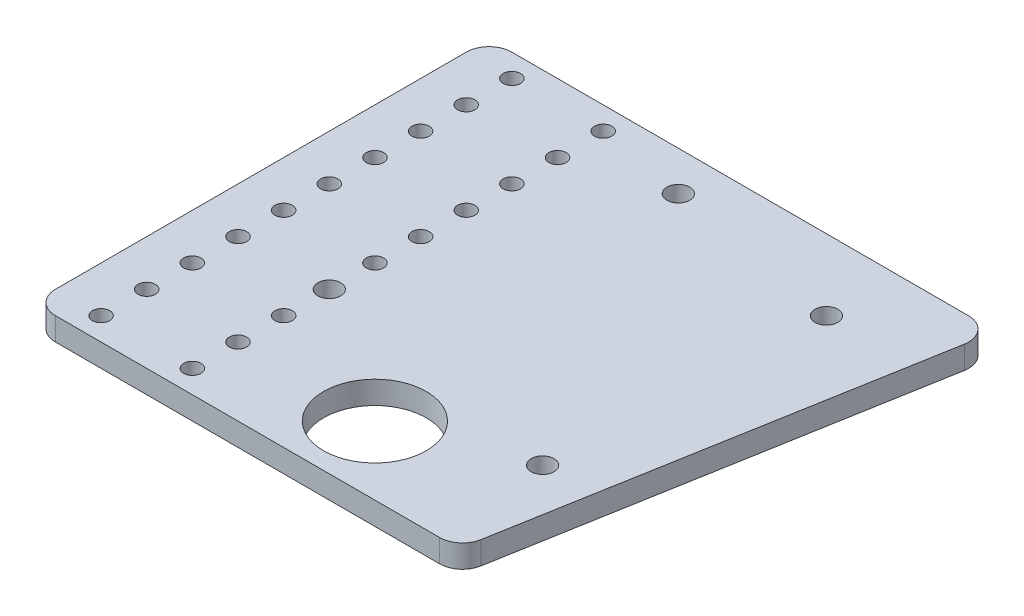
ISO-10303-21;
HEADER;
FILE_DESCRIPTION(('STEP AP214'),'2;1');
FILE_NAME('part.step','',(''),(''),'','','');
FILE_SCHEMA(('AUTOMOTIVE_DESIGN { 1 0 10303 214 1 1 1 1 }'));
ENDSEC;
DATA;
#1=APPLICATION_CONTEXT('core data for automotive mechanical design processes');
#2=APPLICATION_PROTOCOL_DEFINITION('international standard','automotive_design',2000,#1);
#3=PRODUCT_CONTEXT('',#1,'mechanical');
#4=PRODUCT('Part','Part','',(#3));
#5=PRODUCT_RELATED_PRODUCT_CATEGORY('part','',(#4));
#6=PRODUCT_DEFINITION_FORMATION('','',#4);
#7=PRODUCT_DEFINITION_CONTEXT('part definition',#1,'design');
#8=PRODUCT_DEFINITION('design','',#6,#7);
#9=PRODUCT_DEFINITION_SHAPE('','',#8);
#10=(LENGTH_UNIT() NAMED_UNIT(*) SI_UNIT(.MILLI.,.METRE.));
#11=(NAMED_UNIT(*) PLANE_ANGLE_UNIT() SI_UNIT($,.RADIAN.));
#12=(NAMED_UNIT(*) SI_UNIT($,.STERADIAN.) SOLID_ANGLE_UNIT());
#13=UNCERTAINTY_MEASURE_WITH_UNIT(LENGTH_MEASURE(1.E-05),#10,'distance_accuracy_value','');
#14=(GEOMETRIC_REPRESENTATION_CONTEXT(3) GLOBAL_UNCERTAINTY_ASSIGNED_CONTEXT((#13)) GLOBAL_UNIT_ASSIGNED_CONTEXT((#10,
#11,#12)) REPRESENTATION_CONTEXT('',''));
#15=CARTESIAN_POINT('',(0.,0.,0.));
#16=DIRECTION('',(0.,0.,1.));
#17=DIRECTION('',(1.,0.,0.));
#18=AXIS2_PLACEMENT_3D('',#15,#16,#17);
#19=CARTESIAN_POINT('',(-26.303593083181,0.,-62.6287449701072));
#20=DIRECTION('',(0.,1.,0.));
#21=DIRECTION('',(0.,0.,1.));
#22=AXIS2_PLACEMENT_3D('',#19,#20,#21);
#23=CYLINDRICAL_SURFACE('',#22,2.413);
#24=CARTESIAN_POINT('',(-26.303593083181,0.,-62.6287449701072));
#25=DIRECTION('',(0.,1.,0.));
#26=DIRECTION('',(0.,0.,1.));
#27=AXIS2_PLACEMENT_3D('',#24,#25,#26);
#28=CIRCLE('',#27,2.413);
#29=CARTESIAN_POINT('',(-26.303593083181,0.,-60.2157449701072));
#30=VERTEX_POINT('',#29);
#31=EDGE_CURVE('E233',#30,#30,#28,.T.);
#32=ORIENTED_EDGE('',*,*,#31,.F.);
#33=EDGE_LOOP('',(#32));
#34=FACE_BOUND('',#33,.T.);
#35=CARTESIAN_POINT('',(-26.303593083181,6.35,-62.6287449701072));
#36=DIRECTION('',(0.,1.,0.));
#37=DIRECTION('',(0.,0.,1.));
#38=AXIS2_PLACEMENT_3D('',#35,#36,#37);
#39=CIRCLE('',#38,2.413);
#40=CARTESIAN_POINT('',(-26.303593083181,6.35,-60.2157449701072));
#41=VERTEX_POINT('',#40);
#42=EDGE_CURVE('E234',#41,#41,#39,.T.);
#43=ORIENTED_EDGE('',*,*,#42,.T.);
#44=EDGE_LOOP('',(#43));
#45=FACE_BOUND('',#44,.T.);
#46=ADVANCED_FACE('F41',(#34,#45),#23,.F.);
#47=CARTESIAN_POINT('',(-26.303593083181,0.,-49.9287449701072));
#48=DIRECTION('',(0.,1.,0.));
#49=DIRECTION('',(0.,0.,1.));
#50=AXIS2_PLACEMENT_3D('',#47,#48,#49);
#51=CYLINDRICAL_SURFACE('',#50,2.413);
#52=CARTESIAN_POINT('',(-26.303593083181,0.,-49.9287449701072));
#53=DIRECTION('',(0.,1.,0.));
#54=DIRECTION('',(0.,0.,1.));
#55=AXIS2_PLACEMENT_3D('',#52,#53,#54);
#56=CIRCLE('',#55,2.413);
#57=CARTESIAN_POINT('',(-26.303593083181,0.,-47.5157449701072));
#58=VERTEX_POINT('',#57);
#59=EDGE_CURVE('E222',#58,#58,#56,.T.);
#60=ORIENTED_EDGE('',*,*,#59,.F.);
#61=EDGE_LOOP('',(#60));
#62=FACE_BOUND('',#61,.T.);
#63=CARTESIAN_POINT('',(-26.303593083181,6.35,-49.9287449701072));
#64=DIRECTION('',(0.,1.,0.));
#65=DIRECTION('',(0.,0.,1.));
#66=AXIS2_PLACEMENT_3D('',#63,#64,#65);
#67=CIRCLE('',#66,2.413);
#68=CARTESIAN_POINT('',(-26.303593083181,6.35,-47.5157449701072));
#69=VERTEX_POINT('',#68);
#70=EDGE_CURVE('E226',#69,#69,#67,.T.);
#71=ORIENTED_EDGE('',*,*,#70,.T.);
#72=EDGE_LOOP('',(#71));
#73=FACE_BOUND('',#72,.T.);
#74=ADVANCED_FACE('F387',(#62,#73),#51,.F.);
#75=CARTESIAN_POINT('',(-26.303593083181,0.,-37.2287449701072));
#76=DIRECTION('',(0.,1.,0.));
#77=DIRECTION('',(0.,0.,1.));
#78=AXIS2_PLACEMENT_3D('',#75,#76,#77);
#79=CYLINDRICAL_SURFACE('',#78,2.413);
#80=CARTESIAN_POINT('',(-26.303593083181,0.,-37.2287449701072));
#81=DIRECTION('',(0.,1.,0.));
#82=DIRECTION('',(0.,0.,1.));
#83=AXIS2_PLACEMENT_3D('',#80,#81,#82);
#84=CIRCLE('',#83,2.413);
#85=CARTESIAN_POINT('',(-26.303593083181,0.,-34.8157449701072));
#86=VERTEX_POINT('',#85);
#87=EDGE_CURVE('E219',#86,#86,#84,.T.);
#88=ORIENTED_EDGE('',*,*,#87,.F.);
#89=EDGE_LOOP('',(#88));
#90=FACE_BOUND('',#89,.T.);
#91=CARTESIAN_POINT('',(-26.303593083181,6.35,-37.2287449701072));
#92=DIRECTION('',(0.,1.,0.));
#93=DIRECTION('',(0.,0.,1.));
#94=AXIS2_PLACEMENT_3D('',#91,#92,#93);
#95=CIRCLE('',#94,2.413);
#96=CARTESIAN_POINT('',(-26.303593083181,6.35,-34.8157449701072));
#97=VERTEX_POINT('',#96);
#98=EDGE_CURVE('E221',#97,#97,#95,.T.);
#99=ORIENTED_EDGE('',*,*,#98,.T.);
#100=EDGE_LOOP('',(#99));
#101=FACE_BOUND('',#100,.T.);
#102=ADVANCED_FACE('F399',(#90,#101),#79,.F.);
#103=CARTESIAN_POINT('',(-26.303593083181,0.,-24.5287449701072));
#104=DIRECTION('',(0.,1.,0.));
#105=DIRECTION('',(0.,0.,1.));
#106=AXIS2_PLACEMENT_3D('',#103,#104,#105);
#107=CYLINDRICAL_SURFACE('',#106,2.413);
#108=CARTESIAN_POINT('',(-26.303593083181,0.,-24.5287449701072));
#109=DIRECTION('',(0.,1.,0.));
#110=DIRECTION('',(0.,0.,1.));
#111=AXIS2_PLACEMENT_3D('',#108,#109,#110);
#112=CIRCLE('',#111,2.413);
#113=CARTESIAN_POINT('',(-26.303593083181,0.,-22.1157449701072));
#114=VERTEX_POINT('',#113);
#115=EDGE_CURVE('E211',#114,#114,#112,.T.);
#116=ORIENTED_EDGE('',*,*,#115,.F.);
#117=EDGE_LOOP('',(#116));
#118=FACE_BOUND('',#117,.T.);
#119=CARTESIAN_POINT('',(-26.303593083181,6.35,-24.5287449701072));
#120=DIRECTION('',(0.,1.,0.));
#121=DIRECTION('',(0.,0.,1.));
#122=AXIS2_PLACEMENT_3D('',#119,#120,#121);
#123=CIRCLE('',#122,2.413);
#124=CARTESIAN_POINT('',(-26.303593083181,6.35,-22.1157449701072));
#125=VERTEX_POINT('',#124);
#126=EDGE_CURVE('E217',#125,#125,#123,.T.);
#127=ORIENTED_EDGE('',*,*,#126,.T.);
#128=EDGE_LOOP('',(#127));
#129=FACE_BOUND('',#128,.T.);
#130=ADVANCED_FACE('F505',(#118,#129),#107,.F.);
#131=CARTESIAN_POINT('',(-26.303593083181,0.,-11.8287449701072));
#132=DIRECTION('',(0.,1.,0.));
#133=DIRECTION('',(0.,0.,1.));
#134=AXIS2_PLACEMENT_3D('',#131,#132,#133);
#135=CYLINDRICAL_SURFACE('',#134,2.413);
#136=CARTESIAN_POINT('',(-26.303593083181,0.,-11.8287449701072));
#137=DIRECTION('',(0.,1.,0.));
#138=DIRECTION('',(0.,0.,1.));
#139=AXIS2_PLACEMENT_3D('',#136,#137,#138);
#140=CIRCLE('',#139,2.413);
#141=CARTESIAN_POINT('',(-26.303593083181,0.,-9.41574497010722));
#142=VERTEX_POINT('',#141);
#143=EDGE_CURVE('E210',#142,#142,#140,.T.);
#144=ORIENTED_EDGE('',*,*,#143,.F.);
#145=EDGE_LOOP('',(#144));
#146=FACE_BOUND('',#145,.T.);
#147=CARTESIAN_POINT('',(-26.303593083181,6.35,-11.8287449701072));
#148=DIRECTION('',(0.,1.,0.));
#149=DIRECTION('',(0.,0.,1.));
#150=AXIS2_PLACEMENT_3D('',#147,#148,#149);
#151=CIRCLE('',#150,2.413);
#152=CARTESIAN_POINT('',(-26.303593083181,6.35,-9.41574497010722));
#153=VERTEX_POINT('',#152);
#154=EDGE_CURVE('E208',#153,#153,#151,.T.);
#155=ORIENTED_EDGE('',*,*,#154,.T.);
#156=EDGE_LOOP('',(#155));
#157=FACE_BOUND('',#156,.T.);
#158=ADVANCED_FACE('F509',(#146,#157),#135,.F.);
#159=CARTESIAN_POINT('',(-26.303593083181,0.,0.871255029892784));
#160=DIRECTION('',(0.,1.,0.));
#161=DIRECTION('',(0.,0.,1.));
#162=AXIS2_PLACEMENT_3D('',#159,#160,#161);
#163=CYLINDRICAL_SURFACE('',#162,2.413);
#164=CARTESIAN_POINT('',(-26.303593083181,0.,0.871255029892784));
#165=DIRECTION('',(0.,1.,0.));
#166=DIRECTION('',(0.,0.,1.));
#167=AXIS2_PLACEMENT_3D('',#164,#165,#166);
#168=CIRCLE('',#167,2.413);
#169=CARTESIAN_POINT('',(-26.303593083181,0.,3.28425502989278));
#170=VERTEX_POINT('',#169);
#171=EDGE_CURVE('E204',#170,#170,#168,.T.);
#172=ORIENTED_EDGE('',*,*,#171,.F.);
#173=EDGE_LOOP('',(#172));
#174=FACE_BOUND('',#173,.T.);
#175=CARTESIAN_POINT('',(-26.303593083181,6.35,0.871255029892784));
#176=DIRECTION('',(0.,1.,0.));
#177=DIRECTION('',(0.,0.,1.));
#178=AXIS2_PLACEMENT_3D('',#175,#176,#177);
#179=CIRCLE('',#178,2.413);
#180=CARTESIAN_POINT('',(-26.303593083181,6.35,3.28425502989278));
#181=VERTEX_POINT('',#180);
#182=EDGE_CURVE('E203',#181,#181,#179,.T.);
#183=ORIENTED_EDGE('',*,*,#182,.T.);
#184=EDGE_LOOP('',(#183));
#185=FACE_BOUND('',#184,.T.);
#186=ADVANCED_FACE('F517',(#174,#185),#163,.F.);
#187=CARTESIAN_POINT('',(-26.303593083181,0.,26.2712550298928));
#188=DIRECTION('',(0.,1.,0.));
#189=DIRECTION('',(0.,0.,1.));
#190=AXIS2_PLACEMENT_3D('',#187,#188,#189);
#191=CYLINDRICAL_SURFACE('',#190,2.413);
#192=CARTESIAN_POINT('',(-26.303593083181,0.,26.2712550298928));
#193=DIRECTION('',(0.,1.,0.));
#194=DIRECTION('',(0.,0.,1.));
#195=AXIS2_PLACEMENT_3D('',#192,#193,#194);
#196=CIRCLE('',#195,2.413);
#197=CARTESIAN_POINT('',(-26.303593083181,0.,28.6842550298928));
#198=VERTEX_POINT('',#197);
#199=EDGE_CURVE('E194',#198,#198,#196,.T.);
#200=ORIENTED_EDGE('',*,*,#199,.F.);
#201=EDGE_LOOP('',(#200));
#202=FACE_BOUND('',#201,.T.);
#203=CARTESIAN_POINT('',(-26.303593083181,6.35,26.2712550298928));
#204=DIRECTION('',(0.,1.,0.));
#205=DIRECTION('',(0.,0.,1.));
#206=AXIS2_PLACEMENT_3D('',#203,#204,#205);
#207=CIRCLE('',#206,2.413);
#208=CARTESIAN_POINT('',(-26.303593083181,6.35,28.6842550298928));
#209=VERTEX_POINT('',#208);
#210=EDGE_CURVE('E198',#209,#209,#207,.T.);
#211=ORIENTED_EDGE('',*,*,#210,.T.);
#212=EDGE_LOOP('',(#211));
#213=FACE_BOUND('',#212,.T.);
#214=ADVANCED_FACE('F530',(#202,#213),#191,.F.);
#215=CARTESIAN_POINT('',(-51.703593083181,0.,-62.6287449701072));
#216=DIRECTION('',(0.,1.,0.));
#217=DIRECTION('',(0.,0.,1.));
#218=AXIS2_PLACEMENT_3D('',#215,#216,#217);
#219=CYLINDRICAL_SURFACE('',#218,2.41299999999999);
#220=CARTESIAN_POINT('',(-51.703593083181,0.,-62.6287449701072));
#221=DIRECTION('',(0.,1.,0.));
#222=DIRECTION('',(0.,0.,1.));
#223=AXIS2_PLACEMENT_3D('',#220,#221,#222);
#224=CIRCLE('',#223,2.41299999999999);
#225=CARTESIAN_POINT('',(-51.703593083181,0.,-60.2157449701072));
#226=VERTEX_POINT('',#225);
#227=EDGE_CURVE('E186',#226,#226,#224,.T.);
#228=ORIENTED_EDGE('',*,*,#227,.F.);
#229=EDGE_LOOP('',(#228));
#230=FACE_BOUND('',#229,.T.);
#231=CARTESIAN_POINT('',(-51.703593083181,6.35,-62.6287449701072));
#232=DIRECTION('',(0.,1.,0.));
#233=DIRECTION('',(0.,0.,1.));
#234=AXIS2_PLACEMENT_3D('',#231,#232,#233);
#235=CIRCLE('',#234,2.41299999999999);
#236=CARTESIAN_POINT('',(-51.703593083181,6.35,-60.2157449701072));
#237=VERTEX_POINT('',#236);
#238=EDGE_CURVE('E195',#237,#237,#235,.T.);
#239=ORIENTED_EDGE('',*,*,#238,.T.);
#240=EDGE_LOOP('',(#239));
#241=FACE_BOUND('',#240,.T.);
#242=ADVANCED_FACE('F540',(#230,#241),#219,.F.);
#243=CARTESIAN_POINT('',(-51.703593083181,0.,-49.9287449701072));
#244=DIRECTION('',(0.,1.,0.));
#245=DIRECTION('',(0.,0.,1.));
#246=AXIS2_PLACEMENT_3D('',#243,#244,#245);
#247=CYLINDRICAL_SURFACE('',#246,2.41299999999999);
#248=CARTESIAN_POINT('',(-51.703593083181,0.,-49.9287449701072));
#249=DIRECTION('',(0.,1.,0.));
#250=DIRECTION('',(0.,0.,1.));
#251=AXIS2_PLACEMENT_3D('',#248,#249,#250);
#252=CIRCLE('',#251,2.41299999999999);
#253=CARTESIAN_POINT('',(-51.703593083181,0.,-47.5157449701072));
#254=VERTEX_POINT('',#253);
#255=EDGE_CURVE('E182',#254,#254,#252,.T.);
#256=ORIENTED_EDGE('',*,*,#255,.F.);
#257=EDGE_LOOP('',(#256));
#258=FACE_BOUND('',#257,.T.);
#259=CARTESIAN_POINT('',(-51.703593083181,6.35,-49.9287449701072));
#260=DIRECTION('',(0.,1.,0.));
#261=DIRECTION('',(0.,0.,1.));
#262=AXIS2_PLACEMENT_3D('',#259,#260,#261);
#263=CIRCLE('',#262,2.41299999999999);
#264=CARTESIAN_POINT('',(-51.703593083181,6.35,-47.5157449701072));
#265=VERTEX_POINT('',#264);
#266=EDGE_CURVE('E187',#265,#265,#263,.T.);
#267=ORIENTED_EDGE('',*,*,#266,.T.);
#268=EDGE_LOOP('',(#267));
#269=FACE_BOUND('',#268,.T.);
#270=ADVANCED_FACE('F554',(#258,#269),#247,.F.);
#271=CARTESIAN_POINT('',(-51.703593083181,0.,-37.2287449701072));
#272=DIRECTION('',(0.,1.,0.));
#273=DIRECTION('',(0.,0.,1.));
#274=AXIS2_PLACEMENT_3D('',#271,#272,#273);
#275=CYLINDRICAL_SURFACE('',#274,2.41299999999999);
#276=CARTESIAN_POINT('',(-51.703593083181,0.,-37.2287449701072));
#277=DIRECTION('',(0.,1.,0.));
#278=DIRECTION('',(0.,0.,1.));
#279=AXIS2_PLACEMENT_3D('',#276,#277,#278);
#280=CIRCLE('',#279,2.41299999999999);
#281=CARTESIAN_POINT('',(-51.703593083181,0.,-34.8157449701072));
#282=VERTEX_POINT('',#281);
#283=EDGE_CURVE('E180',#282,#282,#280,.T.);
#284=ORIENTED_EDGE('',*,*,#283,.F.);
#285=EDGE_LOOP('',(#284));
#286=FACE_BOUND('',#285,.T.);
#287=CARTESIAN_POINT('',(-51.703593083181,6.35,-37.2287449701072));
#288=DIRECTION('',(0.,1.,0.));
#289=DIRECTION('',(0.,0.,1.));
#290=AXIS2_PLACEMENT_3D('',#287,#288,#289);
#291=CIRCLE('',#290,2.41299999999999);
#292=CARTESIAN_POINT('',(-51.703593083181,6.35,-34.8157449701072));
#293=VERTEX_POINT('',#292);
#294=EDGE_CURVE('E179',#293,#293,#291,.T.);
#295=ORIENTED_EDGE('',*,*,#294,.T.);
#296=EDGE_LOOP('',(#295));
#297=FACE_BOUND('',#296,.T.);
#298=ADVANCED_FACE('F562',(#286,#297),#275,.F.);
#299=CARTESIAN_POINT('',(-51.703593083181,0.,-24.5287449701072));
#300=DIRECTION('',(0.,1.,0.));
#301=DIRECTION('',(0.,0.,1.));
#302=AXIS2_PLACEMENT_3D('',#299,#300,#301);
#303=CYLINDRICAL_SURFACE('',#302,2.41299999999999);
#304=CARTESIAN_POINT('',(-51.703593083181,0.,-24.5287449701072));
#305=DIRECTION('',(0.,1.,0.));
#306=DIRECTION('',(0.,0.,1.));
#307=AXIS2_PLACEMENT_3D('',#304,#305,#306);
#308=CIRCLE('',#307,2.41299999999999);
#309=CARTESIAN_POINT('',(-51.703593083181,0.,-22.1157449701072));
#310=VERTEX_POINT('',#309);
#311=EDGE_CURVE('E171',#310,#310,#308,.T.);
#312=ORIENTED_EDGE('',*,*,#311,.F.);
#313=EDGE_LOOP('',(#312));
#314=FACE_BOUND('',#313,.T.);
#315=CARTESIAN_POINT('',(-51.703593083181,6.35,-24.5287449701072));
#316=DIRECTION('',(0.,1.,0.));
#317=DIRECTION('',(0.,0.,1.));
#318=AXIS2_PLACEMENT_3D('',#315,#316,#317);
#319=CIRCLE('',#318,2.41299999999999);
#320=CARTESIAN_POINT('',(-51.703593083181,6.35,-22.1157449701072));
#321=VERTEX_POINT('',#320);
#322=EDGE_CURVE('E172',#321,#321,#319,.T.);
#323=ORIENTED_EDGE('',*,*,#322,.T.);
#324=EDGE_LOOP('',(#323));
#325=FACE_BOUND('',#324,.T.);
#326=ADVANCED_FACE('F572',(#314,#325),#303,.F.);
#327=CARTESIAN_POINT('',(-51.703593083181,0.,-11.8287449701072));
#328=DIRECTION('',(0.,1.,0.));
#329=DIRECTION('',(0.,0.,1.));
#330=AXIS2_PLACEMENT_3D('',#327,#328,#329);
#331=CYLINDRICAL_SURFACE('',#330,2.41299999999999);
#332=CARTESIAN_POINT('',(-51.703593083181,0.,-11.8287449701072));
#333=DIRECTION('',(0.,1.,0.));
#334=DIRECTION('',(0.,0.,1.));
#335=AXIS2_PLACEMENT_3D('',#332,#333,#334);
#336=CIRCLE('',#335,2.41299999999999);
#337=CARTESIAN_POINT('',(-51.703593083181,0.,-9.41574497010722));
#338=VERTEX_POINT('',#337);
#339=EDGE_CURVE('E164',#338,#338,#336,.T.);
#340=ORIENTED_EDGE('',*,*,#339,.F.);
#341=EDGE_LOOP('',(#340));
#342=FACE_BOUND('',#341,.T.);
#343=CARTESIAN_POINT('',(-51.703593083181,6.35,-11.8287449701072));
#344=DIRECTION('',(0.,1.,0.));
#345=DIRECTION('',(0.,0.,1.));
#346=AXIS2_PLACEMENT_3D('',#343,#344,#345);
#347=CIRCLE('',#346,2.41299999999999);
#348=CARTESIAN_POINT('',(-51.703593083181,6.35,-9.41574497010722));
#349=VERTEX_POINT('',#348);
#350=EDGE_CURVE('E166',#349,#349,#347,.T.);
#351=ORIENTED_EDGE('',*,*,#350,.T.);
#352=EDGE_LOOP('',(#351));
#353=FACE_BOUND('',#352,.T.);
#354=ADVANCED_FACE('F585',(#342,#353),#331,.F.);
#355=CARTESIAN_POINT('',(-51.703593083181,0.,0.871255029892784));
#356=DIRECTION('',(0.,1.,0.));
#357=DIRECTION('',(0.,0.,1.));
#358=AXIS2_PLACEMENT_3D('',#355,#356,#357);
#359=CYLINDRICAL_SURFACE('',#358,2.41299999999999);
#360=CARTESIAN_POINT('',(-51.703593083181,0.,0.871255029892784));
#361=DIRECTION('',(0.,1.,0.));
#362=DIRECTION('',(0.,0.,1.));
#363=AXIS2_PLACEMENT_3D('',#360,#361,#362);
#364=CIRCLE('',#363,2.41299999999999);
#365=CARTESIAN_POINT('',(-51.703593083181,0.,3.28425502989278));
#366=VERTEX_POINT('',#365);
#367=EDGE_CURVE('E158',#366,#366,#364,.T.);
#368=ORIENTED_EDGE('',*,*,#367,.F.);
#369=EDGE_LOOP('',(#368));
#370=FACE_BOUND('',#369,.T.);
#371=CARTESIAN_POINT('',(-51.703593083181,6.35,0.871255029892784));
#372=DIRECTION('',(0.,1.,0.));
#373=DIRECTION('',(0.,0.,1.));
#374=AXIS2_PLACEMENT_3D('',#371,#372,#373);
#375=CIRCLE('',#374,2.41299999999999);
#376=CARTESIAN_POINT('',(-51.703593083181,6.35,3.28425502989278));
#377=VERTEX_POINT('',#376);
#378=EDGE_CURVE('E162',#377,#377,#375,.T.);
#379=ORIENTED_EDGE('',*,*,#378,.T.);
#380=EDGE_LOOP('',(#379));
#381=FACE_BOUND('',#380,.T.);
#382=ADVANCED_FACE('F594',(#370,#381),#359,.F.);
#383=CARTESIAN_POINT('',(-51.703593083181,0.,13.5712550298928));
#384=DIRECTION('',(0.,1.,0.));
#385=DIRECTION('',(0.,0.,1.));
#386=AXIS2_PLACEMENT_3D('',#383,#384,#385);
#387=CYLINDRICAL_SURFACE('',#386,2.41299999999999);
#388=CARTESIAN_POINT('',(-51.703593083181,0.,13.5712550298928));
#389=DIRECTION('',(0.,1.,0.));
#390=DIRECTION('',(0.,0.,1.));
#391=AXIS2_PLACEMENT_3D('',#388,#389,#390);
#392=CIRCLE('',#391,2.41299999999999);
#393=CARTESIAN_POINT('',(-51.703593083181,0.,15.9842550298928));
#394=VERTEX_POINT('',#393);
#395=EDGE_CURVE('E153',#394,#394,#392,.T.);
#396=ORIENTED_EDGE('',*,*,#395,.F.);
#397=EDGE_LOOP('',(#396));
#398=FACE_BOUND('',#397,.T.);
#399=CARTESIAN_POINT('',(-51.703593083181,6.35,13.5712550298928));
#400=DIRECTION('',(0.,1.,0.));
#401=DIRECTION('',(0.,0.,1.));
#402=AXIS2_PLACEMENT_3D('',#399,#400,#401);
#403=CIRCLE('',#402,2.41299999999999);
#404=CARTESIAN_POINT('',(-51.703593083181,6.35,15.9842550298928));
#405=VERTEX_POINT('',#404);
#406=EDGE_CURVE('E159',#405,#405,#403,.T.);
#407=ORIENTED_EDGE('',*,*,#406,.T.);
#408=EDGE_LOOP('',(#407));
#409=FACE_BOUND('',#408,.T.);
#410=ADVANCED_FACE('F598',(#398,#409),#387,.F.);
#411=CARTESIAN_POINT('',(-51.703593083181,0.,26.2712550298928));
#412=DIRECTION('',(0.,1.,0.));
#413=DIRECTION('',(0.,0.,1.));
#414=AXIS2_PLACEMENT_3D('',#411,#412,#413);
#415=CYLINDRICAL_SURFACE('',#414,2.41299999999999);
#416=CARTESIAN_POINT('',(-51.703593083181,0.,26.2712550298928));
#417=DIRECTION('',(0.,1.,0.));
#418=DIRECTION('',(0.,0.,1.));
#419=AXIS2_PLACEMENT_3D('',#416,#417,#418);
#420=CIRCLE('',#419,2.41299999999999);
#421=CARTESIAN_POINT('',(-51.703593083181,0.,28.6842550298928));
#422=VERTEX_POINT('',#421);
#423=EDGE_CURVE('E148',#422,#422,#420,.T.);
#424=ORIENTED_EDGE('',*,*,#423,.F.);
#425=EDGE_LOOP('',(#424));
#426=FACE_BOUND('',#425,.T.);
#427=CARTESIAN_POINT('',(-51.703593083181,6.35,26.2712550298928));
#428=DIRECTION('',(0.,1.,0.));
#429=DIRECTION('',(0.,0.,1.));
#430=AXIS2_PLACEMENT_3D('',#427,#428,#429);
#431=CIRCLE('',#430,2.41299999999999);
#432=CARTESIAN_POINT('',(-51.703593083181,6.35,28.6842550298928));
#433=VERTEX_POINT('',#432);
#434=EDGE_CURVE('E147',#433,#433,#431,.T.);
#435=ORIENTED_EDGE('',*,*,#434,.T.);
#436=EDGE_LOOP('',(#435));
#437=FACE_BOUND('',#436,.T.);
#438=ADVANCED_FACE('F609',(#426,#437),#415,.F.);
#439=CARTESIAN_POINT('',(54.1728803668443,6.35,58.0212550298928));
#440=DIRECTION('',(-0.984807753012209,0.,-0.173648177666927));
#441=DIRECTION('',(-0.173648177666927,0.,0.984807753012209));
#442=AXIS2_PLACEMENT_3D('',#439,#440,#441);
#443=PLANE('',#442);
#444=DIRECTION('',(0.173648177666927,0.,-0.984807753012208));
#445=VECTOR('',#444,1.);
#446=CARTESIAN_POINT('',(54.1728803668443,0.,58.0212550298928));
#447=LINE('',#446,#445);
#448=CARTESIAN_POINT('',(55.0981269404961,0.,52.7739209580778));
#449=VERTEX_POINT('',#448);
#450=CARTESIAN_POINT('',(75.2523008354733,0.,-61.5260790419222));
#451=VERTEX_POINT('',#450);
#452=EDGE_CURVE('E131',#449,#451,#447,.T.);
#453=ORIENTED_EDGE('',*,*,#452,.T.);
#454=DIRECTION('',(0.,-1.,0.));
#455=VECTOR('',#454,1.);
#456=CARTESIAN_POINT('',(75.2523008354733,6.35,-61.5260790419222));
#457=LINE('',#456,#455);
#458=CARTESIAN_POINT('',(75.2523008354733,6.35,-61.5260790419222));
#459=VERTEX_POINT('',#458);
#460=EDGE_CURVE('E115',#451,#459,#457,.F.);
#461=ORIENTED_EDGE('',*,*,#460,.T.);
#462=DIRECTION('',(0.173648177666927,0.,-0.984807753012208));
#463=VECTOR('',#462,1.);
#464=CARTESIAN_POINT('',(54.1728803668443,6.35,58.0212550298928));
#465=LINE('',#464,#463);
#466=CARTESIAN_POINT('',(55.0981269404961,6.35,52.7739209580778));
#467=VERTEX_POINT('',#466);
#468=EDGE_CURVE('E143',#467,#459,#465,.T.);
#469=ORIENTED_EDGE('',*,*,#468,.F.);
#470=DIRECTION('',(0.,-1.,0.));
#471=VECTOR('',#470,1.);
#472=CARTESIAN_POINT('',(55.0981269404961,6.35,52.7739209580778));
#473=LINE('',#472,#471);
#474=EDGE_CURVE('E120',#467,#449,#473,.T.);
#475=ORIENTED_EDGE('',*,*,#474,.T.);
#476=EDGE_LOOP('',(#453,#461,#469,#475));
#477=FACE_BOUND('',#476,.T.);
#478=ADVANCED_FACE('F616',(#477),#443,.F.);
#479=CARTESIAN_POINT('',(-64.403593083181,6.35,-68.9787449701072));
#480=DIRECTION('',(0.,0.,1.));
#481=DIRECTION('',(1.,0.,0.));
#482=AXIS2_PLACEMENT_3D('',#479,#480,#481);
#483=PLANE('',#482);
#484=DIRECTION('',(-1.,0.,0.));
#485=VECTOR('',#484,1.);
#486=CARTESIAN_POINT('',(-64.403593083181,6.35,-68.9787449701072));
#487=LINE('',#486,#485);
#488=CARTESIAN_POINT('',(68.9987716038458,6.35,-68.9787449701072));
#489=VERTEX_POINT('',#488);
#490=CARTESIAN_POINT('',(-58.053593083181,6.35,-68.9787449701072));
#491=VERTEX_POINT('',#490);
#492=EDGE_CURVE('E130',#489,#491,#487,.T.);
#493=ORIENTED_EDGE('',*,*,#492,.F.);
#494=DIRECTION('',(0.,-1.,0.));
#495=VECTOR('',#494,1.);
#496=CARTESIAN_POINT('',(68.9987716038458,6.35,-68.9787449701072));
#497=LINE('',#496,#495);
#498=CARTESIAN_POINT('',(68.9987716038458,0.,-68.9787449701072));
#499=VERTEX_POINT('',#498);
#500=EDGE_CURVE('E111',#489,#499,#497,.T.);
#501=ORIENTED_EDGE('',*,*,#500,.T.);
#502=DIRECTION('',(-1.,0.,0.));
#503=VECTOR('',#502,1.);
#504=CARTESIAN_POINT('',(-64.403593083181,0.,-68.9787449701072));
#505=LINE('',#504,#503);
#506=CARTESIAN_POINT('',(-58.053593083181,0.,-68.9787449701072));
#507=VERTEX_POINT('',#506);
#508=EDGE_CURVE('E121',#499,#507,#505,.T.);
#509=ORIENTED_EDGE('',*,*,#508,.T.);
#510=DIRECTION('',(0.,-1.,0.));
#511=VECTOR('',#510,1.);
#512=CARTESIAN_POINT('',(-58.053593083181,6.35,-68.9787449701072));
#513=LINE('',#512,#511);
#514=EDGE_CURVE('E127',#507,#491,#513,.F.);
#515=ORIENTED_EDGE('',*,*,#514,.T.);
#516=EDGE_LOOP('',(#493,#501,#509,#515));
#517=FACE_BOUND('',#516,.T.);
#518=ADVANCED_FACE('F124',(#517),#483,.F.);
#519=CARTESIAN_POINT('',(-64.403593083181,6.35,58.0212550298928));
#520=DIRECTION('',(1.,0.,0.));
#521=DIRECTION('',(0.,0.,-1.));
#522=AXIS2_PLACEMENT_3D('',#519,#520,#521);
#523=PLANE('',#522);
#524=DIRECTION('',(0.,0.,1.));
#525=VECTOR('',#524,1.);
#526=CARTESIAN_POINT('',(-64.403593083181,0.,58.0212550298928));
#527=LINE('',#526,#525);
#528=CARTESIAN_POINT('',(-64.403593083181,0.,-62.6287449701072));
#529=VERTEX_POINT('',#528);
#530=CARTESIAN_POINT('',(-64.403593083181,0.,51.6712550298928));
#531=VERTEX_POINT('',#530);
#532=EDGE_CURVE('E134',#529,#531,#527,.T.);
#533=ORIENTED_EDGE('',*,*,#532,.T.);
#534=DIRECTION('',(0.,-1.,0.));
#535=VECTOR('',#534,1.);
#536=CARTESIAN_POINT('',(-64.403593083181,6.35,51.6712550298928));
#537=LINE('',#536,#535);
#538=CARTESIAN_POINT('',(-64.403593083181,6.35,51.6712550298928));
#539=VERTEX_POINT('',#538);
#540=EDGE_CURVE('E11',#531,#539,#537,.F.);
#541=ORIENTED_EDGE('',*,*,#540,.T.);
#542=DIRECTION('',(0.,0.,1.));
#543=VECTOR('',#542,1.);
#544=CARTESIAN_POINT('',(-64.403593083181,6.35,58.0212550298928));
#545=LINE('',#544,#543);
#546=CARTESIAN_POINT('',(-64.403593083181,6.35,-62.6287449701072));
#547=VERTEX_POINT('',#546);
#548=EDGE_CURVE('E262',#547,#539,#545,.T.);
#549=ORIENTED_EDGE('',*,*,#548,.F.);
#550=DIRECTION('',(0.,-1.,0.));
#551=VECTOR('',#550,1.);
#552=CARTESIAN_POINT('',(-64.403593083181,6.35,-62.6287449701072));
#553=LINE('',#552,#551);
#554=EDGE_CURVE('E47',#547,#529,#553,.T.);
#555=ORIENTED_EDGE('',*,*,#554,.T.);
#556=EDGE_LOOP('',(#533,#541,#549,#555));
#557=FACE_BOUND('',#556,.T.);
#558=ADVANCED_FACE('F257',(#557),#523,.F.);
#559=CARTESIAN_POINT('',(-64.403593083181,6.35,58.0212550298928));
#560=DIRECTION('',(0.,0.,-1.));
#561=DIRECTION('',(-1.,0.,0.));
#562=AXIS2_PLACEMENT_3D('',#559,#560,#561);
#563=PLANE('',#562);
#564=DIRECTION('',(1.,0.,0.));
#565=VECTOR('',#564,1.);
#566=CARTESIAN_POINT('',(-64.403593083181,0.,58.0212550298928));
#567=LINE('',#566,#565);
#568=CARTESIAN_POINT('',(-58.053593083181,0.,58.0212550298928));
#569=VERTEX_POINT('',#568);
#570=CARTESIAN_POINT('',(48.8445977088686,0.,58.0212550298928));
#571=VERTEX_POINT('',#570);
#572=EDGE_CURVE('E140',#569,#571,#567,.T.);
#573=ORIENTED_EDGE('',*,*,#572,.T.);
#574=DIRECTION('',(0.,-1.,0.));
#575=VECTOR('',#574,1.);
#576=CARTESIAN_POINT('',(48.8445977088686,6.35,58.0212550298928));
#577=LINE('',#576,#575);
#578=CARTESIAN_POINT('',(48.8445977088686,6.35,58.0212550298928));
#579=VERTEX_POINT('',#578);
#580=EDGE_CURVE('E57',#571,#579,#577,.F.);
#581=ORIENTED_EDGE('',*,*,#580,.T.);
#582=DIRECTION('',(1.,0.,0.));
#583=VECTOR('',#582,1.);
#584=CARTESIAN_POINT('',(-64.403593083181,6.35,58.0212550298928));
#585=LINE('',#584,#583);
#586=CARTESIAN_POINT('',(-58.053593083181,6.35,58.0212550298928));
#587=VERTEX_POINT('',#586);
#588=EDGE_CURVE('E149',#587,#579,#585,.T.);
#589=ORIENTED_EDGE('',*,*,#588,.F.);
#590=DIRECTION('',(0.,-1.,0.));
#591=VECTOR('',#590,1.);
#592=CARTESIAN_POINT('',(-58.053593083181,6.35,58.0212550298928));
#593=LINE('',#592,#591);
#594=EDGE_CURVE('E255',#587,#569,#593,.T.);
#595=ORIENTED_EDGE('',*,*,#594,.T.);
#596=EDGE_LOOP('',(#573,#581,#589,#595));
#597=FACE_BOUND('',#596,.T.);
#598=ADVANCED_FACE('F270',(#597),#563,.F.);
#599=CARTESIAN_POINT('',(0.,6.35,0.));
#600=DIRECTION('',(0.,-1.,0.));
#601=DIRECTION('',(0.,0.,-1.));
#602=AXIS2_PLACEMENT_3D('',#599,#600,#601);
#603=PLANE('',#602);
#604=CARTESIAN_POINT('',(11.7926036781181,6.35,38.9775238981094));
#605=DIRECTION('',(0.,1.,0.));
#606=DIRECTION('',(0.,0.,1.));
#607=AXIS2_PLACEMENT_3D('',#604,#605,#606);
#608=CIRCLE('',#607,14.2875);
#609=CARTESIAN_POINT('',(11.7926036781181,6.35,53.2650238981094));
#610=VERTEX_POINT('',#609);
#611=EDGE_CURVE('E321',#610,#610,#608,.T.);
#612=ORIENTED_EDGE('',*,*,#611,.F.);
#613=EDGE_LOOP('',(#612));
#614=FACE_BOUND('',#613,.T.);
#615=CARTESIAN_POINT('',(-0.785076667343414,6.35,-58.0150580469419));
#616=DIRECTION('',(0.,1.,0.));
#617=DIRECTION('',(0.,0.,1.));
#618=AXIS2_PLACEMENT_3D('',#615,#616,#617);
#619=CIRCLE('',#618,3.17499999999999);
#620=CARTESIAN_POINT('',(-0.785076667343414,6.35,-54.8400580469419));
#621=VERTEX_POINT('',#620);
#622=EDGE_CURVE('E319',#621,#621,#619,.T.);
#623=ORIENTED_EDGE('',*,*,#622,.F.);
#624=EDGE_LOOP('',(#623));
#625=FACE_BOUND('',#624,.T.);
#626=CARTESIAN_POINT('',(-26.303593083181,6.35,13.5712550298928));
#627=DIRECTION('',(0.,1.,0.));
#628=DIRECTION('',(0.,0.,1.));
#629=AXIS2_PLACEMENT_3D('',#626,#627,#628);
#630=CIRCLE('',#629,3.175);
#631=CARTESIAN_POINT('',(-26.303593083181,6.35,16.7462550298928));
#632=VERTEX_POINT('',#631);
#633=EDGE_CURVE('E314',#632,#632,#630,.T.);
#634=ORIENTED_EDGE('',*,*,#633,.F.);
#635=EDGE_LOOP('',(#634));
#636=FACE_BOUND('',#635,.T.);
#637=CARTESIAN_POINT('',(45.7370636651682,6.35,26.2739665225835));
#638=DIRECTION('',(0.,1.,0.));
#639=DIRECTION('',(0.,0.,1.));
#640=AXIS2_PLACEMENT_3D('',#637,#638,#639);
#641=CIRCLE('',#640,3.175);
#642=CARTESIAN_POINT('',(45.7370636651682,6.35,29.4489665225835));
#643=VERTEX_POINT('',#642);
#644=EDGE_CURVE('E307',#643,#643,#641,.T.);
#645=ORIENTED_EDGE('',*,*,#644,.F.);
#646=EDGE_LOOP('',(#645));
#647=FACE_BOUND('',#646,.T.);
#648=CARTESIAN_POINT('',(49.2431571856768,6.35,-49.1937306214622));
#649=DIRECTION('',(0.,1.,0.));
#650=DIRECTION('',(0.,0.,1.));
#651=AXIS2_PLACEMENT_3D('',#648,#649,#650);
#652=CIRCLE('',#651,3.17500000000001);
#653=CARTESIAN_POINT('',(49.2431571856768,6.35,-46.0187306214622));
#654=VERTEX_POINT('',#653);
#655=EDGE_CURVE('E305',#654,#654,#652,.T.);
#656=ORIENTED_EDGE('',*,*,#655,.F.);
#657=EDGE_LOOP('',(#656));
#658=FACE_BOUND('',#657,.T.);
#659=CARTESIAN_POINT('',(-26.303593083181,6.35,38.9712550298928));
#660=DIRECTION('',(0.,1.,0.));
#661=DIRECTION('',(0.,0.,1.));
#662=AXIS2_PLACEMENT_3D('',#659,#660,#661);
#663=CIRCLE('',#662,2.413);
#664=CARTESIAN_POINT('',(-26.303593083181,6.35,41.3842550298928));
#665=VERTEX_POINT('',#664);
#666=EDGE_CURVE('E292',#665,#665,#663,.T.);
#667=ORIENTED_EDGE('',*,*,#666,.F.);
#668=EDGE_LOOP('',(#667));
#669=FACE_BOUND('',#668,.T.);
#670=CARTESIAN_POINT('',(-51.703593083181,6.35,38.9712550298928));
#671=DIRECTION('',(0.,1.,0.));
#672=DIRECTION('',(0.,0.,1.));
#673=AXIS2_PLACEMENT_3D('',#670,#671,#672);
#674=CIRCLE('',#673,2.41299999999999);
#675=CARTESIAN_POINT('',(-51.703593083181,6.35,41.3842550298928));
#676=VERTEX_POINT('',#675);
#677=EDGE_CURVE('E277',#676,#676,#674,.T.);
#678=ORIENTED_EDGE('',*,*,#677,.F.);
#679=EDGE_LOOP('',(#678));
#680=FACE_BOUND('',#679,.T.);
#681=CARTESIAN_POINT('',(-51.703593083181,6.35,51.6712550298928));
#682=DIRECTION('',(0.,1.,0.));
#683=DIRECTION('',(0.,0.,1.));
#684=AXIS2_PLACEMENT_3D('',#681,#682,#683);
#685=CIRCLE('',#684,2.41299999999999);
#686=CARTESIAN_POINT('',(-51.703593083181,6.35,54.0842550298928));
#687=VERTEX_POINT('',#686);
#688=EDGE_CURVE('E285',#687,#687,#685,.T.);
#689=ORIENTED_EDGE('',*,*,#688,.F.);
#690=EDGE_LOOP('',(#689));
#691=FACE_BOUND('',#690,.T.);
#692=CARTESIAN_POINT('',(-26.303593083181,6.35,51.6712550298928));
#693=DIRECTION('',(0.,1.,0.));
#694=DIRECTION('',(0.,0.,1.));
#695=AXIS2_PLACEMENT_3D('',#692,#693,#694);
#696=CIRCLE('',#695,2.413);
#697=CARTESIAN_POINT('',(-26.303593083181,6.35,54.0842550298928));
#698=VERTEX_POINT('',#697);
#699=EDGE_CURVE('E276',#698,#698,#696,.T.);
#700=ORIENTED_EDGE('',*,*,#699,.F.);
#701=EDGE_LOOP('',(#700));
#702=FACE_BOUND('',#701,.T.);
#703=ORIENTED_EDGE('',*,*,#468,.T.);
#704=CARTESIAN_POINT('',(68.9987716038458,6.35,-62.6287449701072));
#705=DIRECTION('',(0.,-1.,0.));
#706=DIRECTION('',(0.,0.,-1.));
#707=AXIS2_PLACEMENT_3D('',#704,#705,#706);
#708=CIRCLE('',#707,6.35);
#709=EDGE_CURVE('E249',#459,#489,#708,.F.);
#710=ORIENTED_EDGE('',*,*,#709,.T.);
#711=ORIENTED_EDGE('',*,*,#492,.T.);
#712=CARTESIAN_POINT('',(-58.053593083181,6.35,-62.6287449701072));
#713=DIRECTION('',(0.,-1.,0.));
#714=DIRECTION('',(0.,0.,-1.));
#715=AXIS2_PLACEMENT_3D('',#712,#713,#714);
#716=CIRCLE('',#715,6.35);
#717=EDGE_CURVE('E244',#491,#547,#716,.F.);
#718=ORIENTED_EDGE('',*,*,#717,.T.);
#719=ORIENTED_EDGE('',*,*,#548,.T.);
#720=CARTESIAN_POINT('',(-58.053593083181,6.35,51.6712550298928));
#721=DIRECTION('',(0.,-1.,0.));
#722=DIRECTION('',(0.,0.,-1.));
#723=AXIS2_PLACEMENT_3D('',#720,#721,#722);
#724=CIRCLE('',#723,6.35);
#725=EDGE_CURVE('E61',#539,#587,#724,.F.);
#726=ORIENTED_EDGE('',*,*,#725,.T.);
#727=ORIENTED_EDGE('',*,*,#588,.T.);
#728=CARTESIAN_POINT('',(48.8445977088686,6.35,51.6712550298928));
#729=DIRECTION('',(0.,-1.,0.));
#730=DIRECTION('',(0.,0.,-1.));
#731=AXIS2_PLACEMENT_3D('',#728,#729,#730);
#732=CIRCLE('',#731,6.35);
#733=EDGE_CURVE('E247',#579,#467,#732,.F.);
#734=ORIENTED_EDGE('',*,*,#733,.T.);
#735=EDGE_LOOP('',(#703,#710,#711,#718,#719,#726,#727,#734));
#736=FACE_BOUND('',#735,.T.);
#737=ORIENTED_EDGE('',*,*,#434,.F.);
#738=EDGE_LOOP('',(#737));
#739=FACE_BOUND('',#738,.T.);
#740=ORIENTED_EDGE('',*,*,#406,.F.);
#741=EDGE_LOOP('',(#740));
#742=FACE_BOUND('',#741,.T.);
#743=ORIENTED_EDGE('',*,*,#378,.F.);
#744=EDGE_LOOP('',(#743));
#745=FACE_BOUND('',#744,.T.);
#746=ORIENTED_EDGE('',*,*,#350,.F.);
#747=EDGE_LOOP('',(#746));
#748=FACE_BOUND('',#747,.T.);
#749=ORIENTED_EDGE('',*,*,#322,.F.);
#750=EDGE_LOOP('',(#749));
#751=FACE_BOUND('',#750,.T.);
#752=ORIENTED_EDGE('',*,*,#294,.F.);
#753=EDGE_LOOP('',(#752));
#754=FACE_BOUND('',#753,.T.);
#755=ORIENTED_EDGE('',*,*,#266,.F.);
#756=EDGE_LOOP('',(#755));
#757=FACE_BOUND('',#756,.T.);
#758=ORIENTED_EDGE('',*,*,#238,.F.);
#759=EDGE_LOOP('',(#758));
#760=FACE_BOUND('',#759,.T.);
#761=ORIENTED_EDGE('',*,*,#210,.F.);
#762=EDGE_LOOP('',(#761));
#763=FACE_BOUND('',#762,.T.);
#764=ORIENTED_EDGE('',*,*,#182,.F.);
#765=EDGE_LOOP('',(#764));
#766=FACE_BOUND('',#765,.T.);
#767=ORIENTED_EDGE('',*,*,#154,.F.);
#768=EDGE_LOOP('',(#767));
#769=FACE_BOUND('',#768,.T.);
#770=ORIENTED_EDGE('',*,*,#126,.F.);
#771=EDGE_LOOP('',(#770));
#772=FACE_BOUND('',#771,.T.);
#773=ORIENTED_EDGE('',*,*,#98,.F.);
#774=EDGE_LOOP('',(#773));
#775=FACE_BOUND('',#774,.T.);
#776=ORIENTED_EDGE('',*,*,#70,.F.);
#777=EDGE_LOOP('',(#776));
#778=FACE_BOUND('',#777,.T.);
#779=ORIENTED_EDGE('',*,*,#42,.F.);
#780=EDGE_LOOP('',(#779));
#781=FACE_BOUND('',#780,.T.);
#782=ADVANCED_FACE('F340',(#614,#625,#636,#647,#658,#669,#680,#691,#702,#736,#739,#742,#745,
#748,#751,#754,#757,#760,#763,#766,#769,#772,#775,#778,#781),#603,.F.);
#783=CARTESIAN_POINT('',(0.,0.,0.));
#784=DIRECTION('',(0.,-1.,0.));
#785=DIRECTION('',(0.,0.,-1.));
#786=AXIS2_PLACEMENT_3D('',#783,#784,#785);
#787=PLANE('',#786);
#788=CARTESIAN_POINT('',(11.7926036781181,0.,38.9775238981094));
#789=DIRECTION('',(0.,1.,0.));
#790=DIRECTION('',(0.,0.,1.));
#791=AXIS2_PLACEMENT_3D('',#788,#789,#790);
#792=CIRCLE('',#791,14.2875);
#793=CARTESIAN_POINT('',(11.7926036781181,0.,53.2650238981094));
#794=VERTEX_POINT('',#793);
#795=EDGE_CURVE('E303',#794,#794,#792,.T.);
#796=ORIENTED_EDGE('',*,*,#795,.T.);
#797=EDGE_LOOP('',(#796));
#798=FACE_BOUND('',#797,.T.);
#799=CARTESIAN_POINT('',(-0.785076667343414,0.,-58.0150580469419));
#800=DIRECTION('',(0.,1.,0.));
#801=DIRECTION('',(0.,0.,1.));
#802=AXIS2_PLACEMENT_3D('',#799,#800,#801);
#803=CIRCLE('',#802,3.17499999999999);
#804=CARTESIAN_POINT('',(-0.785076667343414,0.,-54.8400580469419));
#805=VERTEX_POINT('',#804);
#806=EDGE_CURVE('E296',#805,#805,#803,.T.);
#807=ORIENTED_EDGE('',*,*,#806,.T.);
#808=EDGE_LOOP('',(#807));
#809=FACE_BOUND('',#808,.T.);
#810=CARTESIAN_POINT('',(-26.303593083181,0.,13.5712550298928));
#811=DIRECTION('',(0.,1.,0.));
#812=DIRECTION('',(0.,0.,1.));
#813=AXIS2_PLACEMENT_3D('',#810,#811,#812);
#814=CIRCLE('',#813,3.175);
#815=CARTESIAN_POINT('',(-26.303593083181,0.,16.7462550298928));
#816=VERTEX_POINT('',#815);
#817=EDGE_CURVE('E315',#816,#816,#814,.T.);
#818=ORIENTED_EDGE('',*,*,#817,.T.);
#819=EDGE_LOOP('',(#818));
#820=FACE_BOUND('',#819,.T.);
#821=CARTESIAN_POINT('',(45.7370636651682,0.,26.2739665225835));
#822=DIRECTION('',(0.,1.,0.));
#823=DIRECTION('',(0.,0.,1.));
#824=AXIS2_PLACEMENT_3D('',#821,#822,#823);
#825=CIRCLE('',#824,3.175);
#826=CARTESIAN_POINT('',(45.7370636651682,0.,29.4489665225835));
#827=VERTEX_POINT('',#826);
#828=EDGE_CURVE('E306',#827,#827,#825,.T.);
#829=ORIENTED_EDGE('',*,*,#828,.T.);
#830=EDGE_LOOP('',(#829));
#831=FACE_BOUND('',#830,.T.);
#832=CARTESIAN_POINT('',(49.2431571856768,0.,-49.1937306214622));
#833=DIRECTION('',(0.,1.,0.));
#834=DIRECTION('',(0.,0.,1.));
#835=AXIS2_PLACEMENT_3D('',#832,#833,#834);
#836=CIRCLE('',#835,3.17500000000001);
#837=CARTESIAN_POINT('',(49.2431571856768,0.,-46.0187306214622));
#838=VERTEX_POINT('',#837);
#839=EDGE_CURVE('E299',#838,#838,#836,.T.);
#840=ORIENTED_EDGE('',*,*,#839,.T.);
#841=EDGE_LOOP('',(#840));
#842=FACE_BOUND('',#841,.T.);
#843=CARTESIAN_POINT('',(-26.303593083181,0.,38.9712550298928));
#844=DIRECTION('',(0.,1.,0.));
#845=DIRECTION('',(0.,0.,1.));
#846=AXIS2_PLACEMENT_3D('',#843,#844,#845);
#847=CIRCLE('',#846,2.413);
#848=CARTESIAN_POINT('',(-26.303593083181,0.,41.3842550298928));
#849=VERTEX_POINT('',#848);
#850=EDGE_CURVE('E294',#849,#849,#847,.T.);
#851=ORIENTED_EDGE('',*,*,#850,.T.);
#852=EDGE_LOOP('',(#851));
#853=FACE_BOUND('',#852,.T.);
#854=CARTESIAN_POINT('',(-51.703593083181,0.,38.9712550298928));
#855=DIRECTION('',(0.,1.,0.));
#856=DIRECTION('',(0.,0.,1.));
#857=AXIS2_PLACEMENT_3D('',#854,#855,#856);
#858=CIRCLE('',#857,2.41299999999999);
#859=CARTESIAN_POINT('',(-51.703593083181,0.,41.3842550298928));
#860=VERTEX_POINT('',#859);
#861=EDGE_CURVE('E288',#860,#860,#858,.T.);
#862=ORIENTED_EDGE('',*,*,#861,.T.);
#863=EDGE_LOOP('',(#862));
#864=FACE_BOUND('',#863,.T.);
#865=CARTESIAN_POINT('',(-51.703593083181,0.,51.6712550298928));
#866=DIRECTION('',(0.,1.,0.));
#867=DIRECTION('',(0.,0.,1.));
#868=AXIS2_PLACEMENT_3D('',#865,#866,#867);
#869=CIRCLE('',#868,2.41299999999999);
#870=CARTESIAN_POINT('',(-51.703593083181,0.,54.0842550298928));
#871=VERTEX_POINT('',#870);
#872=EDGE_CURVE('E137',#871,#871,#869,.T.);
#873=ORIENTED_EDGE('',*,*,#872,.T.);
#874=EDGE_LOOP('',(#873));
#875=FACE_BOUND('',#874,.T.);
#876=CARTESIAN_POINT('',(-26.303593083181,0.,51.6712550298928));
#877=DIRECTION('',(0.,1.,0.));
#878=DIRECTION('',(0.,0.,1.));
#879=AXIS2_PLACEMENT_3D('',#876,#877,#878);
#880=CIRCLE('',#879,2.413);
#881=CARTESIAN_POINT('',(-26.303593083181,0.,54.0842550298928));
#882=VERTEX_POINT('',#881);
#883=EDGE_CURVE('E273',#882,#882,#880,.T.);
#884=ORIENTED_EDGE('',*,*,#883,.T.);
#885=EDGE_LOOP('',(#884));
#886=FACE_BOUND('',#885,.T.);
#887=ORIENTED_EDGE('',*,*,#508,.F.);
#888=CARTESIAN_POINT('',(68.9987716038458,0.,-62.6287449701072));
#889=DIRECTION('',(0.,-1.,0.));
#890=DIRECTION('',(0.,0.,-1.));
#891=AXIS2_PLACEMENT_3D('',#888,#889,#890);
#892=CIRCLE('',#891,6.35);
#893=EDGE_CURVE('E110',#499,#451,#892,.T.);
#894=ORIENTED_EDGE('',*,*,#893,.T.);
#895=ORIENTED_EDGE('',*,*,#452,.F.);
#896=CARTESIAN_POINT('',(48.8445977088686,0.,51.6712550298928));
#897=DIRECTION('',(0.,-1.,0.));
#898=DIRECTION('',(0.,0.,-1.));
#899=AXIS2_PLACEMENT_3D('',#896,#897,#898);
#900=CIRCLE('',#899,6.35);
#901=EDGE_CURVE('E117',#449,#571,#900,.T.);
#902=ORIENTED_EDGE('',*,*,#901,.T.);
#903=ORIENTED_EDGE('',*,*,#572,.F.);
#904=CARTESIAN_POINT('',(-58.053593083181,0.,51.6712550298928));
#905=DIRECTION('',(0.,-1.,0.));
#906=DIRECTION('',(0.,0.,-1.));
#907=AXIS2_PLACEMENT_3D('',#904,#905,#906);
#908=CIRCLE('',#907,6.35);
#909=EDGE_CURVE('E237',#569,#531,#908,.T.);
#910=ORIENTED_EDGE('',*,*,#909,.T.);
#911=ORIENTED_EDGE('',*,*,#532,.F.);
#912=CARTESIAN_POINT('',(-58.053593083181,0.,-62.6287449701072));
#913=DIRECTION('',(0.,-1.,0.));
#914=DIRECTION('',(0.,0.,-1.));
#915=AXIS2_PLACEMENT_3D('',#912,#913,#914);
#916=CIRCLE('',#915,6.35);
#917=EDGE_CURVE('E126',#529,#507,#916,.T.);
#918=ORIENTED_EDGE('',*,*,#917,.T.);
#919=EDGE_LOOP('',(#887,#894,#895,#902,#903,#910,#911,#918));
#920=FACE_BOUND('',#919,.T.);
#921=ORIENTED_EDGE('',*,*,#423,.T.);
#922=EDGE_LOOP('',(#921));
#923=FACE_BOUND('',#922,.T.);
#924=ORIENTED_EDGE('',*,*,#395,.T.);
#925=EDGE_LOOP('',(#924));
#926=FACE_BOUND('',#925,.T.);
#927=ORIENTED_EDGE('',*,*,#367,.T.);
#928=EDGE_LOOP('',(#927));
#929=FACE_BOUND('',#928,.T.);
#930=ORIENTED_EDGE('',*,*,#339,.T.);
#931=EDGE_LOOP('',(#930));
#932=FACE_BOUND('',#931,.T.);
#933=ORIENTED_EDGE('',*,*,#311,.T.);
#934=EDGE_LOOP('',(#933));
#935=FACE_BOUND('',#934,.T.);
#936=ORIENTED_EDGE('',*,*,#283,.T.);
#937=EDGE_LOOP('',(#936));
#938=FACE_BOUND('',#937,.T.);
#939=ORIENTED_EDGE('',*,*,#255,.T.);
#940=EDGE_LOOP('',(#939));
#941=FACE_BOUND('',#940,.T.);
#942=ORIENTED_EDGE('',*,*,#227,.T.);
#943=EDGE_LOOP('',(#942));
#944=FACE_BOUND('',#943,.T.);
#945=ORIENTED_EDGE('',*,*,#199,.T.);
#946=EDGE_LOOP('',(#945));
#947=FACE_BOUND('',#946,.T.);
#948=ORIENTED_EDGE('',*,*,#171,.T.);
#949=EDGE_LOOP('',(#948));
#950=FACE_BOUND('',#949,.T.);
#951=ORIENTED_EDGE('',*,*,#143,.T.);
#952=EDGE_LOOP('',(#951));
#953=FACE_BOUND('',#952,.T.);
#954=ORIENTED_EDGE('',*,*,#115,.T.);
#955=EDGE_LOOP('',(#954));
#956=FACE_BOUND('',#955,.T.);
#957=ORIENTED_EDGE('',*,*,#87,.T.);
#958=EDGE_LOOP('',(#957));
#959=FACE_BOUND('',#958,.T.);
#960=ORIENTED_EDGE('',*,*,#59,.T.);
#961=EDGE_LOOP('',(#960));
#962=FACE_BOUND('',#961,.T.);
#963=ORIENTED_EDGE('',*,*,#31,.T.);
#964=EDGE_LOOP('',(#963));
#965=FACE_BOUND('',#964,.T.);
#966=ADVANCED_FACE('F132',(#798,#809,#820,#831,#842,#853,#864,#875,#886,#920,#923,#926,#929,
#932,#935,#938,#941,#944,#947,#950,#953,#956,#959,#962,#965),#787,.T.);
#967=CARTESIAN_POINT('',(-26.303593083181,0.,51.6712550298928));
#968=DIRECTION('',(0.,1.,0.));
#969=DIRECTION('',(0.,0.,1.));
#970=AXIS2_PLACEMENT_3D('',#967,#968,#969);
#971=CYLINDRICAL_SURFACE('',#970,2.413);
#972=ORIENTED_EDGE('',*,*,#883,.F.);
#973=EDGE_LOOP('',(#972));
#974=FACE_BOUND('',#973,.T.);
#975=ORIENTED_EDGE('',*,*,#699,.T.);
#976=EDGE_LOOP('',(#975));
#977=FACE_BOUND('',#976,.T.);
#978=ADVANCED_FACE('F425',(#974,#977),#971,.F.);
#979=CARTESIAN_POINT('',(-51.703593083181,0.,51.6712550298928));
#980=DIRECTION('',(0.,1.,0.));
#981=DIRECTION('',(0.,0.,1.));
#982=AXIS2_PLACEMENT_3D('',#979,#980,#981);
#983=CYLINDRICAL_SURFACE('',#982,2.41299999999999);
#984=ORIENTED_EDGE('',*,*,#872,.F.);
#985=EDGE_LOOP('',(#984));
#986=FACE_BOUND('',#985,.T.);
#987=ORIENTED_EDGE('',*,*,#688,.T.);
#988=EDGE_LOOP('',(#987));
#989=FACE_BOUND('',#988,.T.);
#990=ADVANCED_FACE('F626',(#986,#989),#983,.F.);
#991=CARTESIAN_POINT('',(-51.703593083181,0.,38.9712550298928));
#992=DIRECTION('',(0.,1.,0.));
#993=DIRECTION('',(0.,0.,1.));
#994=AXIS2_PLACEMENT_3D('',#991,#992,#993);
#995=CYLINDRICAL_SURFACE('',#994,2.41299999999999);
#996=ORIENTED_EDGE('',*,*,#861,.F.);
#997=EDGE_LOOP('',(#996));
#998=FACE_BOUND('',#997,.T.);
#999=ORIENTED_EDGE('',*,*,#677,.T.);
#1000=EDGE_LOOP('',(#999));
#1001=FACE_BOUND('',#1000,.T.);
#1002=ADVANCED_FACE('F549',(#998,#1001),#995,.F.);
#1003=CARTESIAN_POINT('',(-26.303593083181,0.,38.9712550298928));
#1004=DIRECTION('',(0.,1.,0.));
#1005=DIRECTION('',(0.,0.,1.));
#1006=AXIS2_PLACEMENT_3D('',#1003,#1004,#1005);
#1007=CYLINDRICAL_SURFACE('',#1006,2.413);
#1008=ORIENTED_EDGE('',*,*,#850,.F.);
#1009=EDGE_LOOP('',(#1008));
#1010=FACE_BOUND('',#1009,.T.);
#1011=ORIENTED_EDGE('',*,*,#666,.T.);
#1012=EDGE_LOOP('',(#1011));
#1013=FACE_BOUND('',#1012,.T.);
#1014=ADVANCED_FACE('F481',(#1010,#1013),#1007,.F.);
#1015=CARTESIAN_POINT('',(49.2431571856768,0.,-49.1937306214622));
#1016=DIRECTION('',(0.,1.,0.));
#1017=DIRECTION('',(0.,0.,1.));
#1018=AXIS2_PLACEMENT_3D('',#1015,#1016,#1017);
#1019=CYLINDRICAL_SURFACE('',#1018,3.17500000000001);
#1020=ORIENTED_EDGE('',*,*,#839,.F.);
#1021=EDGE_LOOP('',(#1020));
#1022=FACE_BOUND('',#1021,.T.);
#1023=ORIENTED_EDGE('',*,*,#655,.T.);
#1024=EDGE_LOOP('',(#1023));
#1025=FACE_BOUND('',#1024,.T.);
#1026=ADVANCED_FACE('F471',(#1022,#1025),#1019,.F.);
#1027=CARTESIAN_POINT('',(45.7370636651682,0.,26.2739665225835));
#1028=DIRECTION('',(0.,1.,0.));
#1029=DIRECTION('',(0.,0.,1.));
#1030=AXIS2_PLACEMENT_3D('',#1027,#1028,#1029);
#1031=CYLINDRICAL_SURFACE('',#1030,3.175);
#1032=ORIENTED_EDGE('',*,*,#828,.F.);
#1033=EDGE_LOOP('',(#1032));
#1034=FACE_BOUND('',#1033,.T.);
#1035=ORIENTED_EDGE('',*,*,#644,.T.);
#1036=EDGE_LOOP('',(#1035));
#1037=FACE_BOUND('',#1036,.T.);
#1038=ADVANCED_FACE('F463',(#1034,#1037),#1031,.F.);
#1039=CARTESIAN_POINT('',(-26.303593083181,0.,13.5712550298928));
#1040=DIRECTION('',(0.,1.,0.));
#1041=DIRECTION('',(0.,0.,1.));
#1042=AXIS2_PLACEMENT_3D('',#1039,#1040,#1041);
#1043=CYLINDRICAL_SURFACE('',#1042,3.175);
#1044=ORIENTED_EDGE('',*,*,#817,.F.);
#1045=EDGE_LOOP('',(#1044));
#1046=FACE_BOUND('',#1045,.T.);
#1047=ORIENTED_EDGE('',*,*,#633,.T.);
#1048=EDGE_LOOP('',(#1047));
#1049=FACE_BOUND('',#1048,.T.);
#1050=ADVANCED_FACE('F454',(#1046,#1049),#1043,.F.);
#1051=CARTESIAN_POINT('',(-0.785076667343414,0.,-58.0150580469419));
#1052=DIRECTION('',(0.,1.,0.));
#1053=DIRECTION('',(0.,0.,1.));
#1054=AXIS2_PLACEMENT_3D('',#1051,#1052,#1053);
#1055=CYLINDRICAL_SURFACE('',#1054,3.17499999999999);
#1056=ORIENTED_EDGE('',*,*,#806,.F.);
#1057=EDGE_LOOP('',(#1056));
#1058=FACE_BOUND('',#1057,.T.);
#1059=ORIENTED_EDGE('',*,*,#622,.T.);
#1060=EDGE_LOOP('',(#1059));
#1061=FACE_BOUND('',#1060,.T.);
#1062=ADVANCED_FACE('F403',(#1058,#1061),#1055,.F.);
#1063=CARTESIAN_POINT('',(68.9987716038458,6.35,-62.6287449701072));
#1064=DIRECTION('',(0.,-1.,0.));
#1065=DIRECTION('',(0.,0.,-1.));
#1066=AXIS2_PLACEMENT_3D('',#1063,#1064,#1065);
#1067=CYLINDRICAL_SURFACE('',#1066,6.35);
#1068=ORIENTED_EDGE('',*,*,#709,.F.);
#1069=ORIENTED_EDGE('',*,*,#460,.F.);
#1070=ORIENTED_EDGE('',*,*,#893,.F.);
#1071=ORIENTED_EDGE('',*,*,#500,.F.);
#1072=EDGE_LOOP('',(#1068,#1069,#1070,#1071));
#1073=FACE_BOUND('',#1072,.T.);
#1074=ADVANCED_FACE('F109',(#1073),#1067,.T.);
#1075=CARTESIAN_POINT('',(48.8445977088686,6.35,51.6712550298928));
#1076=DIRECTION('',(0.,-1.,0.));
#1077=DIRECTION('',(0.,0.,-1.));
#1078=AXIS2_PLACEMENT_3D('',#1075,#1076,#1077);
#1079=CYLINDRICAL_SURFACE('',#1078,6.35);
#1080=ORIENTED_EDGE('',*,*,#733,.F.);
#1081=ORIENTED_EDGE('',*,*,#580,.F.);
#1082=ORIENTED_EDGE('',*,*,#901,.F.);
#1083=ORIENTED_EDGE('',*,*,#474,.F.);
#1084=EDGE_LOOP('',(#1080,#1081,#1082,#1083));
#1085=FACE_BOUND('',#1084,.T.);
#1086=ADVANCED_FACE('F404',(#1085),#1079,.T.);
#1087=CARTESIAN_POINT('',(-58.053593083181,6.35,51.6712550298928));
#1088=DIRECTION('',(0.,-1.,0.));
#1089=DIRECTION('',(0.,0.,-1.));
#1090=AXIS2_PLACEMENT_3D('',#1087,#1088,#1089);
#1091=CYLINDRICAL_SURFACE('',#1090,6.35);
#1092=ORIENTED_EDGE('',*,*,#725,.F.);
#1093=ORIENTED_EDGE('',*,*,#540,.F.);
#1094=ORIENTED_EDGE('',*,*,#909,.F.);
#1095=ORIENTED_EDGE('',*,*,#594,.F.);
#1096=EDGE_LOOP('',(#1092,#1093,#1094,#1095));
#1097=FACE_BOUND('',#1096,.T.);
#1098=ADVANCED_FACE('F266',(#1097),#1091,.T.);
#1099=CARTESIAN_POINT('',(-58.053593083181,6.35,-62.6287449701072));
#1100=DIRECTION('',(0.,-1.,0.));
#1101=DIRECTION('',(0.,0.,-1.));
#1102=AXIS2_PLACEMENT_3D('',#1099,#1100,#1101);
#1103=CYLINDRICAL_SURFACE('',#1102,6.35);
#1104=ORIENTED_EDGE('',*,*,#717,.F.);
#1105=ORIENTED_EDGE('',*,*,#514,.F.);
#1106=ORIENTED_EDGE('',*,*,#917,.F.);
#1107=ORIENTED_EDGE('',*,*,#554,.F.);
#1108=EDGE_LOOP('',(#1104,#1105,#1106,#1107));
#1109=FACE_BOUND('',#1108,.T.);
#1110=ADVANCED_FACE('F43',(#1109),#1103,.T.);
#1111=CARTESIAN_POINT('',(11.7926036781181,0.,38.9775238981094));
#1112=DIRECTION('',(0.,1.,0.));
#1113=DIRECTION('',(0.,0.,1.));
#1114=AXIS2_PLACEMENT_3D('',#1111,#1112,#1113);
#1115=CYLINDRICAL_SURFACE('',#1114,14.2875);
#1116=ORIENTED_EDGE('',*,*,#795,.F.);
#1117=EDGE_LOOP('',(#1116));
#1118=FACE_BOUND('',#1117,.T.);
#1119=ORIENTED_EDGE('',*,*,#611,.T.);
#1120=EDGE_LOOP('',(#1119));
#1121=FACE_BOUND('',#1120,.T.);
#1122=ADVANCED_FACE('F334',(#1118,#1121),#1115,.F.);
#1123=CLOSED_SHELL('',(#46,#74,#102,#130,#158,#186,#214,#242,#270,#298,#326,#354,#382,#410,#438,
#478,#518,#558,#598,#782,#966,#978,#990,#1002,#1014,#1026,#1038,#1050,#1062,#1074,#1086,#1098,
#1110,#1122));
#1124=MANIFOLD_SOLID_BREP('B2',#1123);
#1125=ADVANCED_BREP_SHAPE_REPRESENTATION('',(#18,#1124),#14);
#1126=SHAPE_DEFINITION_REPRESENTATION(#9,#1125);
ENDSEC;
END-ISO-10303-21;
